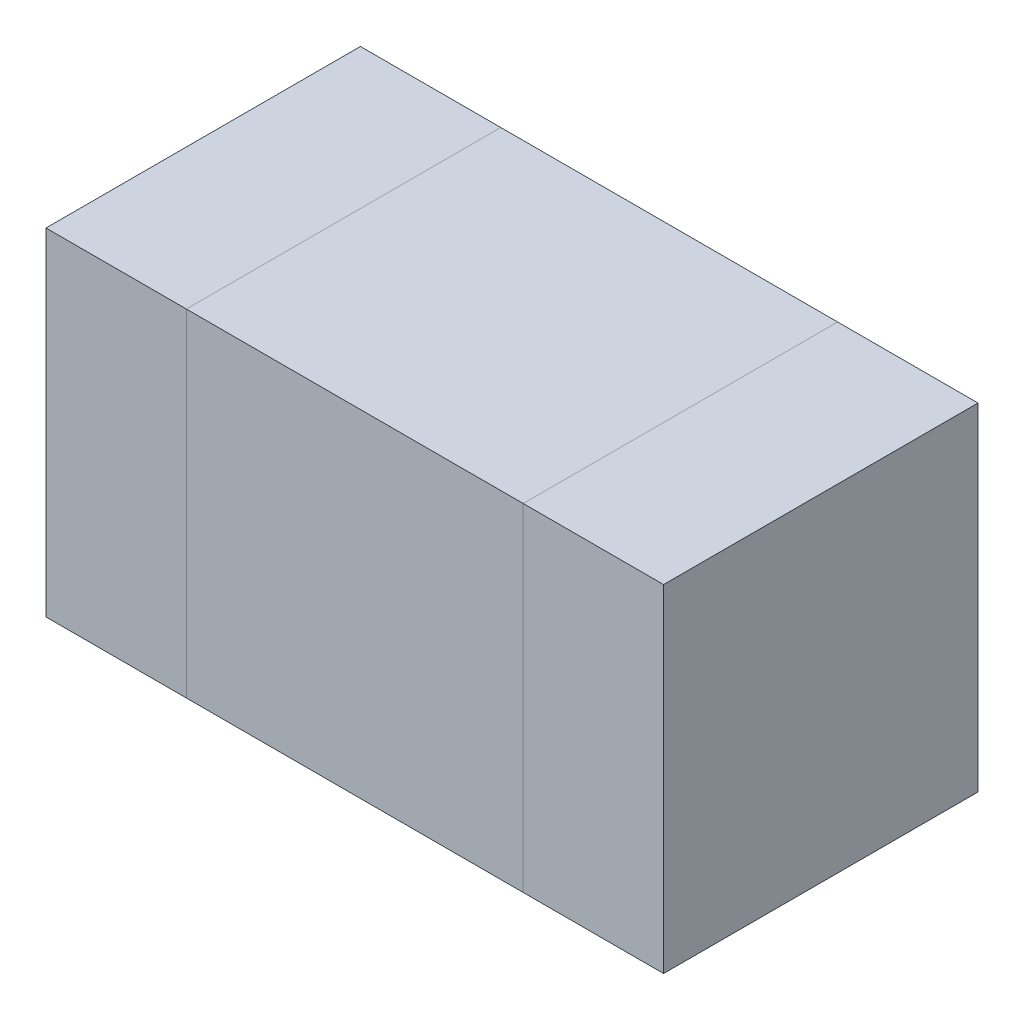
ISO-10303-21;
HEADER;
FILE_DESCRIPTION(('STEP AP214'),'2;1');
FILE_NAME('part.step','',(''),(''),'','','');
FILE_SCHEMA(('AUTOMOTIVE_DESIGN { 1 0 10303 214 1 1 1 1 }'));
ENDSEC;
DATA;
#1=APPLICATION_CONTEXT('core data for automotive mechanical design processes');
#2=APPLICATION_PROTOCOL_DEFINITION('international standard','automotive_design',2000,#1);
#3=PRODUCT_CONTEXT('',#1,'mechanical');
#4=PRODUCT('Part','Part','',(#3));
#5=PRODUCT_RELATED_PRODUCT_CATEGORY('part','',(#4));
#6=PRODUCT_DEFINITION_FORMATION('','',#4);
#7=PRODUCT_DEFINITION_CONTEXT('part definition',#1,'design');
#8=PRODUCT_DEFINITION('design','',#6,#7);
#9=PRODUCT_DEFINITION_SHAPE('','',#8);
#10=(LENGTH_UNIT() NAMED_UNIT(*) SI_UNIT(.MILLI.,.METRE.));
#11=(NAMED_UNIT(*) PLANE_ANGLE_UNIT() SI_UNIT($,.RADIAN.));
#12=(NAMED_UNIT(*) SI_UNIT($,.STERADIAN.) SOLID_ANGLE_UNIT());
#13=UNCERTAINTY_MEASURE_WITH_UNIT(LENGTH_MEASURE(1.E-05),#10,'distance_accuracy_value','');
#14=(GEOMETRIC_REPRESENTATION_CONTEXT(3) GLOBAL_UNCERTAINTY_ASSIGNED_CONTEXT((#13)) GLOBAL_UNIT_ASSIGNED_CONTEXT((#10,
#11,#12)) REPRESENTATION_CONTEXT('',''));
#15=CARTESIAN_POINT('',(0.,0.,0.));
#16=DIRECTION('',(0.,0.,1.));
#17=DIRECTION('',(1.,0.,0.));
#18=AXIS2_PLACEMENT_3D('',#15,#16,#17);
#19=CARTESIAN_POINT('',(0.2999994,-0.2999994,0.));
#20=DIRECTION('',(-1.,0.,0.));
#21=DIRECTION('',(0.,1.,0.));
#22=AXIS2_PLACEMENT_3D('',#19,#20,#21);
#23=PLANE('',#22);
#24=DIRECTION('',(0.,1.,0.));
#25=VECTOR('',#24,1.);
#26=CARTESIAN_POINT('',(0.2999994,-0.2999994,0.));
#27=LINE('',#26,#25);
#28=CARTESIAN_POINT('',(0.2999994,-0.2999994,0.));
#29=VERTEX_POINT('',#28);
#30=CARTESIAN_POINT('',(0.2999994,0.2999994,0.));
#31=VERTEX_POINT('',#30);
#32=EDGE_CURVE('P0_E10',#29,#31,#27,.T.);
#33=ORIENTED_EDGE('',*,*,#32,.T.);
#34=DIRECTION('',(0.,0.,1.));
#35=VECTOR('',#34,1.);
#36=CARTESIAN_POINT('',(0.2999994,0.2999994,0.));
#37=LINE('',#36,#35);
#38=CARTESIAN_POINT('',(0.2999994,0.2999994,0.55999888));
#39=VERTEX_POINT('',#38);
#40=EDGE_CURVE('P0_E23',#31,#39,#37,.T.);
#41=ORIENTED_EDGE('',*,*,#40,.T.);
#42=DIRECTION('',(0.,1.,0.));
#43=VECTOR('',#42,1.);
#44=CARTESIAN_POINT('',(0.2999994,-0.2999994,0.55999888));
#45=LINE('',#44,#43);
#46=CARTESIAN_POINT('',(0.2999994,-0.2999994,0.55999888));
#47=VERTEX_POINT('',#46);
#48=EDGE_CURVE('P0_E85',#47,#39,#45,.T.);
#49=ORIENTED_EDGE('',*,*,#48,.F.);
#50=DIRECTION('',(0.,0.,1.));
#51=VECTOR('',#50,1.);
#52=CARTESIAN_POINT('',(0.2999994,-0.2999994,0.));
#53=LINE('',#52,#51);
#54=EDGE_CURVE('P0_E36',#29,#47,#53,.T.);
#55=ORIENTED_EDGE('',*,*,#54,.F.);
#56=EDGE_LOOP('',(#33,#41,#49,#55));
#57=FACE_BOUND('',#56,.T.);
#58=ADVANCED_FACE('P0_F16',(#57),#23,.F.);
#59=CARTESIAN_POINT('',(0.2999994,0.2999994,0.));
#60=DIRECTION('',(0.,-1.,0.));
#61=DIRECTION('',(-1.,0.,0.));
#62=AXIS2_PLACEMENT_3D('',#59,#60,#61);
#63=PLANE('',#62);
#64=DIRECTION('',(-1.,0.,0.));
#65=VECTOR('',#64,1.);
#66=CARTESIAN_POINT('',(0.2999994,0.2999994,0.));
#67=LINE('',#66,#65);
#68=CARTESIAN_POINT('',(-0.30000194,0.2999994,0.));
#69=VERTEX_POINT('',#68);
#70=EDGE_CURVE('P0_E30',#31,#69,#67,.T.);
#71=ORIENTED_EDGE('',*,*,#70,.T.);
#72=DIRECTION('',(0.,0.,1.));
#73=VECTOR('',#72,1.);
#74=CARTESIAN_POINT('',(-0.30000194,0.2999994,0.));
#75=LINE('',#74,#73);
#76=CARTESIAN_POINT('',(-0.30000194,0.2999994,0.55999888));
#77=VERTEX_POINT('',#76);
#78=EDGE_CURVE('P0_E81',#69,#77,#75,.T.);
#79=ORIENTED_EDGE('',*,*,#78,.T.);
#80=DIRECTION('',(-1.,0.,0.));
#81=VECTOR('',#80,1.);
#82=CARTESIAN_POINT('',(0.2999994,0.2999994,0.55999888));
#83=LINE('',#82,#81);
#84=EDGE_CURVE('P0_E61',#39,#77,#83,.T.);
#85=ORIENTED_EDGE('',*,*,#84,.F.);
#86=ORIENTED_EDGE('',*,*,#40,.F.);
#87=EDGE_LOOP('',(#71,#79,#85,#86));
#88=FACE_BOUND('',#87,.T.);
#89=ADVANCED_FACE('P0_F89',(#88),#63,.F.);
#90=CARTESIAN_POINT('',(-0.30000194,0.2999994,0.));
#91=DIRECTION('',(1.,0.,0.));
#92=DIRECTION('',(0.,-1.,0.));
#93=AXIS2_PLACEMENT_3D('',#90,#91,#92);
#94=PLANE('',#93);
#95=DIRECTION('',(0.,-1.,0.));
#96=VECTOR('',#95,1.);
#97=CARTESIAN_POINT('',(-0.30000194,0.2999994,0.));
#98=LINE('',#97,#96);
#99=CARTESIAN_POINT('',(-0.30000194,-0.2999994,0.));
#100=VERTEX_POINT('',#99);
#101=EDGE_CURVE('P0_E74',#69,#100,#98,.T.);
#102=ORIENTED_EDGE('',*,*,#101,.T.);
#103=DIRECTION('',(0.,0.,1.));
#104=VECTOR('',#103,1.);
#105=CARTESIAN_POINT('',(-0.30000194,-0.2999994,0.));
#106=LINE('',#105,#104);
#107=CARTESIAN_POINT('',(-0.30000194,-0.2999994,0.55999888));
#108=VERTEX_POINT('',#107);
#109=EDGE_CURVE('P0_E66',#100,#108,#106,.T.);
#110=ORIENTED_EDGE('',*,*,#109,.T.);
#111=DIRECTION('',(0.,-1.,0.));
#112=VECTOR('',#111,1.);
#113=CARTESIAN_POINT('',(-0.30000194,0.2999994,0.55999888));
#114=LINE('',#113,#112);
#115=EDGE_CURVE('P0_E56',#77,#108,#114,.T.);
#116=ORIENTED_EDGE('',*,*,#115,.F.);
#117=ORIENTED_EDGE('',*,*,#78,.F.);
#118=EDGE_LOOP('',(#102,#110,#116,#117));
#119=FACE_BOUND('',#118,.T.);
#120=ADVANCED_FACE('P0_F73',(#119),#94,.F.);
#121=CARTESIAN_POINT('',(-0.30000194,-0.2999994,0.));
#122=DIRECTION('',(0.,1.,0.));
#123=DIRECTION('',(1.,0.,0.));
#124=AXIS2_PLACEMENT_3D('',#121,#122,#123);
#125=PLANE('',#124);
#126=DIRECTION('',(1.,0.,0.));
#127=VECTOR('',#126,1.);
#128=CARTESIAN_POINT('',(-0.30000194,-0.2999994,0.));
#129=LINE('',#128,#127);
#130=EDGE_CURVE('P0_E67',#100,#29,#129,.T.);
#131=ORIENTED_EDGE('',*,*,#130,.T.);
#132=ORIENTED_EDGE('',*,*,#54,.T.);
#133=DIRECTION('',(1.,0.,0.));
#134=VECTOR('',#133,1.);
#135=CARTESIAN_POINT('',(-0.30000194,-0.2999994,0.55999888));
#136=LINE('',#135,#134);
#137=EDGE_CURVE('P0_E59',#108,#47,#136,.T.);
#138=ORIENTED_EDGE('',*,*,#137,.F.);
#139=ORIENTED_EDGE('',*,*,#109,.F.);
#140=EDGE_LOOP('',(#131,#132,#138,#139));
#141=FACE_BOUND('',#140,.T.);
#142=ADVANCED_FACE('P0_F71',(#141),#125,.F.);
#143=CARTESIAN_POINT('',(0.2999994,-0.2999994,0.));
#144=DIRECTION('',(0.,0.,-1.));
#145=DIRECTION('',(0.,-1.,0.));
#146=AXIS2_PLACEMENT_3D('',#143,#144,#145);
#147=PLANE('',#146);
#148=ORIENTED_EDGE('',*,*,#130,.F.);
#149=ORIENTED_EDGE('',*,*,#101,.F.);
#150=ORIENTED_EDGE('',*,*,#70,.F.);
#151=ORIENTED_EDGE('',*,*,#32,.F.);
#152=EDGE_LOOP('',(#148,#149,#150,#151));
#153=FACE_BOUND('',#152,.T.);
#154=ADVANCED_FACE('P0_F90',(#153),#147,.T.);
#155=CARTESIAN_POINT('',(0.2999994,-0.2999994,0.55999888));
#156=DIRECTION('',(0.,0.,-1.));
#157=DIRECTION('',(0.,-1.,0.));
#158=AXIS2_PLACEMENT_3D('',#155,#156,#157);
#159=PLANE('',#158);
#160=ORIENTED_EDGE('',*,*,#48,.T.);
#161=ORIENTED_EDGE('',*,*,#84,.T.);
#162=ORIENTED_EDGE('',*,*,#115,.T.);
#163=ORIENTED_EDGE('',*,*,#137,.T.);
#164=EDGE_LOOP('',(#160,#161,#162,#163));
#165=FACE_BOUND('',#164,.T.);
#166=ADVANCED_FACE('P0_F58',(#165),#159,.F.);
#167=CLOSED_SHELL('',(#58,#89,#120,#142,#154,#166));
#168=MANIFOLD_SOLID_BREP('P0_B1',#167);
#169=CARTESIAN_POINT('',(-0.2999994,-0.2999994,0.));
#170=DIRECTION('',(-1.,0.,0.));
#171=DIRECTION('',(0.,1.,0.));
#172=AXIS2_PLACEMENT_3D('',#169,#170,#171);
#173=PLANE('',#172);
#174=DIRECTION('',(0.,1.,0.));
#175=VECTOR('',#174,1.);
#176=CARTESIAN_POINT('',(-0.2999994,-0.2999994,0.));
#177=LINE('',#176,#175);
#178=CARTESIAN_POINT('',(-0.2999994,-0.2999994,0.));
#179=VERTEX_POINT('',#178);
#180=CARTESIAN_POINT('',(-0.2999994,0.2999994,0.));
#181=VERTEX_POINT('',#180);
#182=EDGE_CURVE('P1_E11',#179,#181,#177,.T.);
#183=ORIENTED_EDGE('',*,*,#182,.T.);
#184=DIRECTION('',(0.,0.,1.));
#185=VECTOR('',#184,1.);
#186=CARTESIAN_POINT('',(-0.2999994,0.2999994,0.));
#187=LINE('',#186,#185);
#188=CARTESIAN_POINT('',(-0.2999994,0.2999994,0.55999888));
#189=VERTEX_POINT('',#188);
#190=EDGE_CURVE('P1_E24',#181,#189,#187,.T.);
#191=ORIENTED_EDGE('',*,*,#190,.T.);
#192=DIRECTION('',(0.,1.,0.));
#193=VECTOR('',#192,1.);
#194=CARTESIAN_POINT('',(-0.2999994,-0.2999994,0.55999888));
#195=LINE('',#194,#193);
#196=CARTESIAN_POINT('',(-0.2999994,-0.2999994,0.55999888));
#197=VERTEX_POINT('',#196);
#198=EDGE_CURVE('P1_E86',#197,#189,#195,.T.);
#199=ORIENTED_EDGE('',*,*,#198,.F.);
#200=DIRECTION('',(0.,0.,1.));
#201=VECTOR('',#200,1.);
#202=CARTESIAN_POINT('',(-0.2999994,-0.2999994,0.));
#203=LINE('',#202,#201);
#204=EDGE_CURVE('P1_E37',#179,#197,#203,.T.);
#205=ORIENTED_EDGE('',*,*,#204,.F.);
#206=EDGE_LOOP('',(#183,#191,#199,#205));
#207=FACE_BOUND('',#206,.T.);
#208=ADVANCED_FACE('P1_F17',(#207),#173,.F.);
#209=CARTESIAN_POINT('',(-0.2999994,0.2999994,0.));
#210=DIRECTION('',(0.,-1.,0.));
#211=DIRECTION('',(-1.,0.,0.));
#212=AXIS2_PLACEMENT_3D('',#209,#210,#211);
#213=PLANE('',#212);
#214=DIRECTION('',(-1.,0.,0.));
#215=VECTOR('',#214,1.);
#216=CARTESIAN_POINT('',(-0.2999994,0.2999994,0.));
#217=LINE('',#216,#215);
#218=CARTESIAN_POINT('',(-0.5499989,0.2999994,0.));
#219=VERTEX_POINT('',#218);
#220=EDGE_CURVE('P1_E31',#181,#219,#217,.T.);
#221=ORIENTED_EDGE('',*,*,#220,.T.);
#222=DIRECTION('',(0.,0.,1.));
#223=VECTOR('',#222,1.);
#224=CARTESIAN_POINT('',(-0.5499989,0.2999994,0.));
#225=LINE('',#224,#223);
#226=CARTESIAN_POINT('',(-0.5499989,0.2999994,0.55999888));
#227=VERTEX_POINT('',#226);
#228=EDGE_CURVE('P1_E82',#219,#227,#225,.T.);
#229=ORIENTED_EDGE('',*,*,#228,.T.);
#230=DIRECTION('',(-1.,0.,0.));
#231=VECTOR('',#230,1.);
#232=CARTESIAN_POINT('',(-0.2999994,0.2999994,0.55999888));
#233=LINE('',#232,#231);
#234=EDGE_CURVE('P1_E61',#189,#227,#233,.T.);
#235=ORIENTED_EDGE('',*,*,#234,.F.);
#236=ORIENTED_EDGE('',*,*,#190,.F.);
#237=EDGE_LOOP('',(#221,#229,#235,#236));
#238=FACE_BOUND('',#237,.T.);
#239=ADVANCED_FACE('P1_F90',(#238),#213,.F.);
#240=CARTESIAN_POINT('',(-0.5499989,0.2999994,0.));
#241=DIRECTION('',(1.,0.,0.));
#242=DIRECTION('',(0.,-1.,0.));
#243=AXIS2_PLACEMENT_3D('',#240,#241,#242);
#244=PLANE('',#243);
#245=DIRECTION('',(0.,-1.,0.));
#246=VECTOR('',#245,1.);
#247=CARTESIAN_POINT('',(-0.5499989,0.2999994,0.));
#248=LINE('',#247,#246);
#249=CARTESIAN_POINT('',(-0.5499989,-0.2999994,0.));
#250=VERTEX_POINT('',#249);
#251=EDGE_CURVE('P1_E75',#219,#250,#248,.T.);
#252=ORIENTED_EDGE('',*,*,#251,.T.);
#253=DIRECTION('',(0.,0.,1.));
#254=VECTOR('',#253,1.);
#255=CARTESIAN_POINT('',(-0.5499989,-0.2999994,0.));
#256=LINE('',#255,#254);
#257=CARTESIAN_POINT('',(-0.5499989,-0.2999994,0.55999888));
#258=VERTEX_POINT('',#257);
#259=EDGE_CURVE('P1_E66',#250,#258,#256,.T.);
#260=ORIENTED_EDGE('',*,*,#259,.T.);
#261=DIRECTION('',(0.,-1.,0.));
#262=VECTOR('',#261,1.);
#263=CARTESIAN_POINT('',(-0.5499989,0.2999994,0.55999888));
#264=LINE('',#263,#262);
#265=EDGE_CURVE('P1_E56',#227,#258,#264,.T.);
#266=ORIENTED_EDGE('',*,*,#265,.F.);
#267=ORIENTED_EDGE('',*,*,#228,.F.);
#268=EDGE_LOOP('',(#252,#260,#266,#267));
#269=FACE_BOUND('',#268,.T.);
#270=ADVANCED_FACE('P1_F74',(#269),#244,.F.);
#271=CARTESIAN_POINT('',(-0.5499989,-0.2999994,0.));
#272=DIRECTION('',(0.,1.,0.));
#273=DIRECTION('',(1.,0.,0.));
#274=AXIS2_PLACEMENT_3D('',#271,#272,#273);
#275=PLANE('',#274);
#276=DIRECTION('',(1.,0.,0.));
#277=VECTOR('',#276,1.);
#278=CARTESIAN_POINT('',(-0.5499989,-0.2999994,0.));
#279=LINE('',#278,#277);
#280=EDGE_CURVE('P1_E67',#250,#179,#279,.T.);
#281=ORIENTED_EDGE('',*,*,#280,.T.);
#282=ORIENTED_EDGE('',*,*,#204,.T.);
#283=DIRECTION('',(1.,0.,0.));
#284=VECTOR('',#283,1.);
#285=CARTESIAN_POINT('',(-0.5499989,-0.2999994,0.55999888));
#286=LINE('',#285,#284);
#287=EDGE_CURVE('P1_E59',#258,#197,#286,.T.);
#288=ORIENTED_EDGE('',*,*,#287,.F.);
#289=ORIENTED_EDGE('',*,*,#259,.F.);
#290=EDGE_LOOP('',(#281,#282,#288,#289));
#291=FACE_BOUND('',#290,.T.);
#292=ADVANCED_FACE('P1_F72',(#291),#275,.F.);
#293=CARTESIAN_POINT('',(-0.2999994,-0.2999994,0.));
#294=DIRECTION('',(0.,0.,-1.));
#295=DIRECTION('',(0.,-1.,0.));
#296=AXIS2_PLACEMENT_3D('',#293,#294,#295);
#297=PLANE('',#296);
#298=ORIENTED_EDGE('',*,*,#280,.F.);
#299=ORIENTED_EDGE('',*,*,#251,.F.);
#300=ORIENTED_EDGE('',*,*,#220,.F.);
#301=ORIENTED_EDGE('',*,*,#182,.F.);
#302=EDGE_LOOP('',(#298,#299,#300,#301));
#303=FACE_BOUND('',#302,.T.);
#304=ADVANCED_FACE('P1_F91',(#303),#297,.T.);
#305=CARTESIAN_POINT('',(-0.2999994,-0.2999994,0.55999888));
#306=DIRECTION('',(0.,0.,-1.));
#307=DIRECTION('',(0.,-1.,0.));
#308=AXIS2_PLACEMENT_3D('',#305,#306,#307);
#309=PLANE('',#308);
#310=ORIENTED_EDGE('',*,*,#198,.T.);
#311=ORIENTED_EDGE('',*,*,#234,.T.);
#312=ORIENTED_EDGE('',*,*,#265,.T.);
#313=ORIENTED_EDGE('',*,*,#287,.T.);
#314=EDGE_LOOP('',(#310,#311,#312,#313));
#315=FACE_BOUND('',#314,.T.);
#316=ADVANCED_FACE('P1_F58',(#315),#309,.F.);
#317=CLOSED_SHELL('',(#208,#239,#270,#292,#304,#316));
#318=MANIFOLD_SOLID_BREP('P1_B1',#317);
#319=CARTESIAN_POINT('',(0.5499989,-0.2999994,0.));
#320=DIRECTION('',(-1.,0.,0.));
#321=DIRECTION('',(0.,1.,0.));
#322=AXIS2_PLACEMENT_3D('',#319,#320,#321);
#323=PLANE('',#322);
#324=DIRECTION('',(0.,1.,0.));
#325=VECTOR('',#324,1.);
#326=CARTESIAN_POINT('',(0.5499989,-0.2999994,0.));
#327=LINE('',#326,#325);
#328=CARTESIAN_POINT('',(0.5499989,-0.2999994,0.));
#329=VERTEX_POINT('',#328);
#330=CARTESIAN_POINT('',(0.5499989,0.2999994,0.));
#331=VERTEX_POINT('',#330);
#332=EDGE_CURVE('P2_E10',#329,#331,#327,.T.);
#333=ORIENTED_EDGE('',*,*,#332,.T.);
#334=DIRECTION('',(0.,0.,1.));
#335=VECTOR('',#334,1.);
#336=CARTESIAN_POINT('',(0.5499989,0.2999994,0.));
#337=LINE('',#336,#335);
#338=CARTESIAN_POINT('',(0.5499989,0.2999994,0.55999888));
#339=VERTEX_POINT('',#338);
#340=EDGE_CURVE('P2_E23',#331,#339,#337,.T.);
#341=ORIENTED_EDGE('',*,*,#340,.T.);
#342=DIRECTION('',(0.,1.,0.));
#343=VECTOR('',#342,1.);
#344=CARTESIAN_POINT('',(0.5499989,-0.2999994,0.55999888));
#345=LINE('',#344,#343);
#346=CARTESIAN_POINT('',(0.5499989,-0.2999994,0.55999888));
#347=VERTEX_POINT('',#346);
#348=EDGE_CURVE('P2_E85',#347,#339,#345,.T.);
#349=ORIENTED_EDGE('',*,*,#348,.F.);
#350=DIRECTION('',(0.,0.,1.));
#351=VECTOR('',#350,1.);
#352=CARTESIAN_POINT('',(0.5499989,-0.2999994,0.));
#353=LINE('',#352,#351);
#354=EDGE_CURVE('P2_E36',#329,#347,#353,.T.);
#355=ORIENTED_EDGE('',*,*,#354,.F.);
#356=EDGE_LOOP('',(#333,#341,#349,#355));
#357=FACE_BOUND('',#356,.T.);
#358=ADVANCED_FACE('P2_F16',(#357),#323,.F.);
#359=CARTESIAN_POINT('',(0.5499989,0.2999994,0.));
#360=DIRECTION('',(0.,-1.,0.));
#361=DIRECTION('',(-1.,0.,0.));
#362=AXIS2_PLACEMENT_3D('',#359,#360,#361);
#363=PLANE('',#362);
#364=DIRECTION('',(-1.,0.,0.));
#365=VECTOR('',#364,1.);
#366=CARTESIAN_POINT('',(0.5499989,0.2999994,0.));
#367=LINE('',#366,#365);
#368=CARTESIAN_POINT('',(0.2999994,0.2999994,0.));
#369=VERTEX_POINT('',#368);
#370=EDGE_CURVE('P2_E30',#331,#369,#367,.T.);
#371=ORIENTED_EDGE('',*,*,#370,.T.);
#372=DIRECTION('',(0.,0.,1.));
#373=VECTOR('',#372,1.);
#374=CARTESIAN_POINT('',(0.2999994,0.2999994,0.));
#375=LINE('',#374,#373);
#376=CARTESIAN_POINT('',(0.2999994,0.2999994,0.55999888));
#377=VERTEX_POINT('',#376);
#378=EDGE_CURVE('P2_E81',#369,#377,#375,.T.);
#379=ORIENTED_EDGE('',*,*,#378,.T.);
#380=DIRECTION('',(-1.,0.,0.));
#381=VECTOR('',#380,1.);
#382=CARTESIAN_POINT('',(0.5499989,0.2999994,0.55999888));
#383=LINE('',#382,#381);
#384=EDGE_CURVE('P2_E61',#339,#377,#383,.T.);
#385=ORIENTED_EDGE('',*,*,#384,.F.);
#386=ORIENTED_EDGE('',*,*,#340,.F.);
#387=EDGE_LOOP('',(#371,#379,#385,#386));
#388=FACE_BOUND('',#387,.T.);
#389=ADVANCED_FACE('P2_F89',(#388),#363,.F.);
#390=CARTESIAN_POINT('',(0.2999994,0.2999994,0.));
#391=DIRECTION('',(1.,0.,0.));
#392=DIRECTION('',(0.,-1.,0.));
#393=AXIS2_PLACEMENT_3D('',#390,#391,#392);
#394=PLANE('',#393);
#395=DIRECTION('',(0.,-1.,0.));
#396=VECTOR('',#395,1.);
#397=CARTESIAN_POINT('',(0.2999994,0.2999994,0.));
#398=LINE('',#397,#396);
#399=CARTESIAN_POINT('',(0.2999994,-0.2999994,0.));
#400=VERTEX_POINT('',#399);
#401=EDGE_CURVE('P2_E75',#369,#400,#398,.T.);
#402=ORIENTED_EDGE('',*,*,#401,.T.);
#403=DIRECTION('',(0.,0.,1.));
#404=VECTOR('',#403,1.);
#405=CARTESIAN_POINT('',(0.2999994,-0.2999994,0.));
#406=LINE('',#405,#404);
#407=CARTESIAN_POINT('',(0.2999994,-0.2999994,0.55999888));
#408=VERTEX_POINT('',#407);
#409=EDGE_CURVE('P2_E65',#400,#408,#406,.T.);
#410=ORIENTED_EDGE('',*,*,#409,.T.);
#411=DIRECTION('',(0.,-1.,0.));
#412=VECTOR('',#411,1.);
#413=CARTESIAN_POINT('',(0.2999994,0.2999994,0.55999888));
#414=LINE('',#413,#412);
#415=EDGE_CURVE('P2_E56',#377,#408,#414,.T.);
#416=ORIENTED_EDGE('',*,*,#415,.F.);
#417=ORIENTED_EDGE('',*,*,#378,.F.);
#418=EDGE_LOOP('',(#402,#410,#416,#417));
#419=FACE_BOUND('',#418,.T.);
#420=ADVANCED_FACE('P2_F74',(#419),#394,.F.);
#421=CARTESIAN_POINT('',(0.2999994,-0.2999994,0.));
#422=DIRECTION('',(0.,1.,0.));
#423=DIRECTION('',(1.,0.,0.));
#424=AXIS2_PLACEMENT_3D('',#421,#422,#423);
#425=PLANE('',#424);
#426=DIRECTION('',(1.,0.,0.));
#427=VECTOR('',#426,1.);
#428=CARTESIAN_POINT('',(0.2999994,-0.2999994,0.));
#429=LINE('',#428,#427);
#430=EDGE_CURVE('P2_E66',#400,#329,#429,.T.);
#431=ORIENTED_EDGE('',*,*,#430,.T.);
#432=ORIENTED_EDGE('',*,*,#354,.T.);
#433=DIRECTION('',(1.,0.,0.));
#434=VECTOR('',#433,1.);
#435=CARTESIAN_POINT('',(0.2999994,-0.2999994,0.55999888));
#436=LINE('',#435,#434);
#437=EDGE_CURVE('P2_E59',#408,#347,#436,.T.);
#438=ORIENTED_EDGE('',*,*,#437,.F.);
#439=ORIENTED_EDGE('',*,*,#409,.F.);
#440=EDGE_LOOP('',(#431,#432,#438,#439));
#441=FACE_BOUND('',#440,.T.);
#442=ADVANCED_FACE('P2_F71',(#441),#425,.F.);
#443=CARTESIAN_POINT('',(0.5499989,-0.2999994,0.));
#444=DIRECTION('',(0.,0.,-1.));
#445=DIRECTION('',(0.,-1.,0.));
#446=AXIS2_PLACEMENT_3D('',#443,#444,#445);
#447=PLANE('',#446);
#448=ORIENTED_EDGE('',*,*,#430,.F.);
#449=ORIENTED_EDGE('',*,*,#401,.F.);
#450=ORIENTED_EDGE('',*,*,#370,.F.);
#451=ORIENTED_EDGE('',*,*,#332,.F.);
#452=EDGE_LOOP('',(#448,#449,#450,#451));
#453=FACE_BOUND('',#452,.T.);
#454=ADVANCED_FACE('P2_F90',(#453),#447,.T.);
#455=CARTESIAN_POINT('',(0.5499989,-0.2999994,0.55999888));
#456=DIRECTION('',(0.,0.,-1.));
#457=DIRECTION('',(0.,-1.,0.));
#458=AXIS2_PLACEMENT_3D('',#455,#456,#457);
#459=PLANE('',#458);
#460=ORIENTED_EDGE('',*,*,#348,.T.);
#461=ORIENTED_EDGE('',*,*,#384,.T.);
#462=ORIENTED_EDGE('',*,*,#415,.T.);
#463=ORIENTED_EDGE('',*,*,#437,.T.);
#464=EDGE_LOOP('',(#460,#461,#462,#463));
#465=FACE_BOUND('',#464,.T.);
#466=ADVANCED_FACE('P2_F58',(#465),#459,.F.);
#467=CLOSED_SHELL('',(#358,#389,#420,#442,#454,#466));
#468=MANIFOLD_SOLID_BREP('P2_B1',#467);
#469=ADVANCED_BREP_SHAPE_REPRESENTATION('',(#18,#168,#318,#468),#14);
#470=SHAPE_DEFINITION_REPRESENTATION(#9,#469);
ENDSEC;
END-ISO-10303-21;
